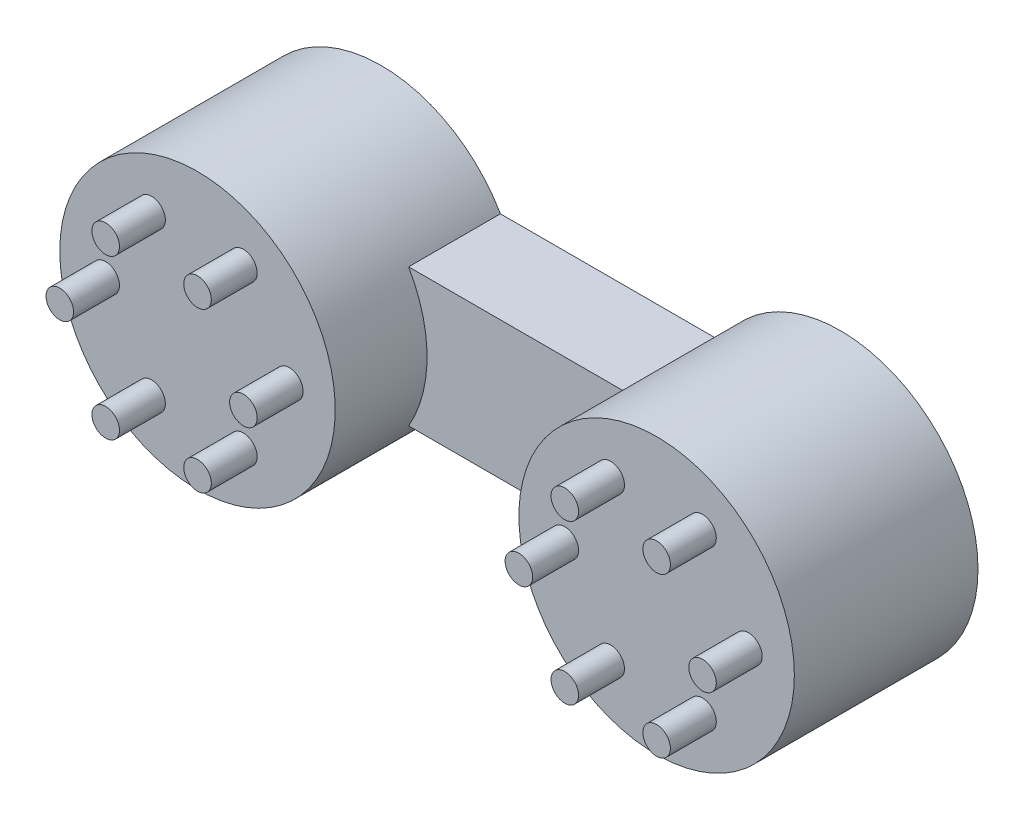
ISO-10303-21;
HEADER;
FILE_DESCRIPTION(('STEP AP214'),'2;1');
FILE_NAME('part.step','',(''),(''),'','','');
FILE_SCHEMA(('AUTOMOTIVE_DESIGN { 1 0 10303 214 1 1 1 1 }'));
ENDSEC;
DATA;
#1=APPLICATION_CONTEXT('core data for automotive mechanical design processes');
#2=APPLICATION_PROTOCOL_DEFINITION('international standard','automotive_design',2000,#1);
#3=PRODUCT_CONTEXT('',#1,'mechanical');
#4=PRODUCT('Part','Part','',(#3));
#5=PRODUCT_RELATED_PRODUCT_CATEGORY('part','',(#4));
#6=PRODUCT_DEFINITION_FORMATION('','',#4);
#7=PRODUCT_DEFINITION_CONTEXT('part definition',#1,'design');
#8=PRODUCT_DEFINITION('design','',#6,#7);
#9=PRODUCT_DEFINITION_SHAPE('','',#8);
#10=(LENGTH_UNIT() NAMED_UNIT(*) SI_UNIT(.MILLI.,.METRE.));
#11=(NAMED_UNIT(*) PLANE_ANGLE_UNIT() SI_UNIT($,.RADIAN.));
#12=(NAMED_UNIT(*) SI_UNIT($,.STERADIAN.) SOLID_ANGLE_UNIT());
#13=UNCERTAINTY_MEASURE_WITH_UNIT(LENGTH_MEASURE(1.E-05),#10,'distance_accuracy_value','');
#14=(GEOMETRIC_REPRESENTATION_CONTEXT(3) GLOBAL_UNCERTAINTY_ASSIGNED_CONTEXT((#13)) GLOBAL_UNIT_ASSIGNED_CONTEXT((#10,
#11,#12)) REPRESENTATION_CONTEXT('',''));
#15=CARTESIAN_POINT('',(0.,0.,0.));
#16=DIRECTION('',(0.,0.,1.));
#17=DIRECTION('',(1.,0.,0.));
#18=AXIS2_PLACEMENT_3D('',#15,#16,#17);
#19=CARTESIAN_POINT('',(-25.,7.5,10.));
#20=DIRECTION('',(0.,-1.,0.));
#21=DIRECTION('',(1.,0.,0.));
#22=AXIS2_PLACEMENT_3D('',#19,#20,#21);
#23=PLANE('',#22);
#24=DIRECTION('',(0.,0.,-1.));
#25=VECTOR('',#24,1.);
#26=CARTESIAN_POINT('',(-12.0096189432334,7.5,20.));
#27=LINE('',#26,#25);
#28=CARTESIAN_POINT('',(-12.0096189432334,7.5,10.));
#29=VERTEX_POINT('',#28);
#30=CARTESIAN_POINT('',(-12.0096189432334,7.5,0.));
#31=VERTEX_POINT('',#30);
#32=EDGE_CURVE('E82',#29,#31,#27,.T.);
#33=ORIENTED_EDGE('',*,*,#32,.F.);
#34=DIRECTION('',(-1.,0.,0.));
#35=VECTOR('',#34,1.);
#36=CARTESIAN_POINT('',(-25.,7.5,10.));
#37=LINE('',#36,#35);
#38=CARTESIAN_POINT('',(12.0096189432334,7.5,10.));
#39=VERTEX_POINT('',#38);
#40=EDGE_CURVE('E100',#39,#29,#37,.T.);
#41=ORIENTED_EDGE('',*,*,#40,.F.);
#42=DIRECTION('',(0.,0.,-1.));
#43=VECTOR('',#42,1.);
#44=CARTESIAN_POINT('',(12.0096189432334,7.5,20.));
#45=LINE('',#44,#43);
#46=CARTESIAN_POINT('',(12.0096189432334,7.5,0.));
#47=VERTEX_POINT('',#46);
#48=EDGE_CURVE('E110',#39,#47,#45,.T.);
#49=ORIENTED_EDGE('',*,*,#48,.T.);
#50=DIRECTION('',(-1.,0.,0.));
#51=VECTOR('',#50,1.);
#52=CARTESIAN_POINT('',(-25.,7.5,0.));
#53=LINE('',#52,#51);
#54=EDGE_CURVE('E101',#47,#31,#53,.T.);
#55=ORIENTED_EDGE('',*,*,#54,.T.);
#56=EDGE_LOOP('',(#33,#41,#49,#55));
#57=FACE_BOUND('',#56,.T.);
#58=ADVANCED_FACE('F40',(#57),#23,.F.);
#59=CARTESIAN_POINT('',(-25.,-7.5,10.));
#60=DIRECTION('',(0.,1.,0.));
#61=DIRECTION('',(-1.,0.,0.));
#62=AXIS2_PLACEMENT_3D('',#59,#60,#61);
#63=PLANE('',#62);
#64=DIRECTION('',(0.,0.,-1.));
#65=VECTOR('',#64,1.);
#66=CARTESIAN_POINT('',(-12.0096189432334,-7.5,20.));
#67=LINE('',#66,#65);
#68=CARTESIAN_POINT('',(-12.0096189432334,-7.5,0.));
#69=VERTEX_POINT('',#68);
#70=CARTESIAN_POINT('',(-12.0096189432334,-7.5,10.));
#71=VERTEX_POINT('',#70);
#72=EDGE_CURVE('E55',#69,#71,#67,.F.);
#73=ORIENTED_EDGE('',*,*,#72,.F.);
#74=DIRECTION('',(1.,0.,0.));
#75=VECTOR('',#74,1.);
#76=CARTESIAN_POINT('',(-25.,-7.5,0.));
#77=LINE('',#76,#75);
#78=CARTESIAN_POINT('',(12.0096189432334,-7.5,0.));
#79=VERTEX_POINT('',#78);
#80=EDGE_CURVE('E93',#69,#79,#77,.T.);
#81=ORIENTED_EDGE('',*,*,#80,.T.);
#82=DIRECTION('',(0.,0.,-1.));
#83=VECTOR('',#82,1.);
#84=CARTESIAN_POINT('',(12.0096189432334,-7.5,20.));
#85=LINE('',#84,#83);
#86=CARTESIAN_POINT('',(12.0096189432334,-7.5,10.));
#87=VERTEX_POINT('',#86);
#88=EDGE_CURVE('E108',#79,#87,#85,.F.);
#89=ORIENTED_EDGE('',*,*,#88,.T.);
#90=DIRECTION('',(1.,0.,0.));
#91=VECTOR('',#90,1.);
#92=CARTESIAN_POINT('',(-25.,-7.5,10.));
#93=LINE('',#92,#91);
#94=EDGE_CURVE('E61',#71,#87,#93,.T.);
#95=ORIENTED_EDGE('',*,*,#94,.F.);
#96=EDGE_LOOP('',(#73,#81,#89,#95));
#97=FACE_BOUND('',#96,.T.);
#98=ADVANCED_FACE('F91',(#97),#63,.F.);
#99=CARTESIAN_POINT('',(25.,0.,20.));
#100=DIRECTION('',(0.,0.,-1.));
#101=DIRECTION('',(-1.,0.,0.));
#102=AXIS2_PLACEMENT_3D('',#99,#100,#101);
#103=CYLINDRICAL_SURFACE('',#102,15.);
#104=CARTESIAN_POINT('',(25.,0.,20.));
#105=DIRECTION('',(0.,0.,1.));
#106=DIRECTION('',(1.,0.,0.));
#107=AXIS2_PLACEMENT_3D('',#104,#105,#106);
#108=CIRCLE('',#107,15.);
#109=CARTESIAN_POINT('',(40.,0.,20.));
#110=VERTEX_POINT('',#109);
#111=EDGE_CURVE('E149',#110,#110,#108,.T.);
#112=ORIENTED_EDGE('',*,*,#111,.F.);
#113=EDGE_LOOP('',(#112));
#114=FACE_BOUND('',#113,.T.);
#115=ORIENTED_EDGE('',*,*,#48,.F.);
#116=CARTESIAN_POINT('',(25.,0.,10.));
#117=DIRECTION('',(0.,0.,1.));
#118=DIRECTION('',(1.,0.,0.));
#119=AXIS2_PLACEMENT_3D('',#116,#117,#118);
#120=CIRCLE('',#119,15.);
#121=EDGE_CURVE('E48',#39,#87,#120,.T.);
#122=ORIENTED_EDGE('',*,*,#121,.T.);
#123=ORIENTED_EDGE('',*,*,#88,.F.);
#124=CARTESIAN_POINT('',(25.,0.,0.));
#125=DIRECTION('',(0.,0.,1.));
#126=DIRECTION('',(1.,0.,0.));
#127=AXIS2_PLACEMENT_3D('',#124,#125,#126);
#128=CIRCLE('',#127,15.);
#129=EDGE_CURVE('E98',#79,#47,#128,.T.);
#130=ORIENTED_EDGE('',*,*,#129,.T.);
#131=EDGE_LOOP('',(#115,#122,#123,#130));
#132=FACE_BOUND('',#131,.T.);
#133=ADVANCED_FACE('F42',(#114,#132),#103,.T.);
#134=CARTESIAN_POINT('',(25.,0.,20.));
#135=DIRECTION('',(0.,0.,1.));
#136=DIRECTION('',(1.,0.,0.));
#137=AXIS2_PLACEMENT_3D('',#134,#135,#136);
#138=PLANE('',#137);
#139=CARTESIAN_POINT('',(30.,8.66025403784439,20.));
#140=DIRECTION('',(0.,0.,1.));
#141=DIRECTION('',(1.,0.,0.));
#142=AXIS2_PLACEMENT_3D('',#139,#140,#141);
#143=CIRCLE('',#142,1.50000000000002);
#144=CARTESIAN_POINT('',(31.5,8.66025403784439,20.));
#145=VERTEX_POINT('',#144);
#146=EDGE_CURVE('E113',#145,#145,#143,.T.);
#147=ORIENTED_EDGE('',*,*,#146,.F.);
#148=EDGE_LOOP('',(#147));
#149=FACE_BOUND('',#148,.T.);
#150=CARTESIAN_POINT('',(20.,8.66025403784439,20.));
#151=DIRECTION('',(0.,0.,1.));
#152=DIRECTION('',(1.,0.,0.));
#153=AXIS2_PLACEMENT_3D('',#150,#151,#152);
#154=CIRCLE('',#153,1.50000000000001);
#155=CARTESIAN_POINT('',(21.5,8.66025403784439,20.));
#156=VERTEX_POINT('',#155);
#157=EDGE_CURVE('E117',#156,#156,#154,.T.);
#158=ORIENTED_EDGE('',*,*,#157,.F.);
#159=EDGE_LOOP('',(#158));
#160=FACE_BOUND('',#159,.T.);
#161=CARTESIAN_POINT('',(15.,0.,20.));
#162=DIRECTION('',(0.,0.,1.));
#163=DIRECTION('',(1.,0.,0.));
#164=AXIS2_PLACEMENT_3D('',#161,#162,#163);
#165=CIRCLE('',#164,1.5);
#166=CARTESIAN_POINT('',(16.5,0.,20.));
#167=VERTEX_POINT('',#166);
#168=EDGE_CURVE('E123',#167,#167,#165,.T.);
#169=ORIENTED_EDGE('',*,*,#168,.F.);
#170=EDGE_LOOP('',(#169));
#171=FACE_BOUND('',#170,.T.);
#172=CARTESIAN_POINT('',(20.,-8.66025403784439,20.));
#173=DIRECTION('',(0.,0.,1.));
#174=DIRECTION('',(1.,0.,0.));
#175=AXIS2_PLACEMENT_3D('',#172,#173,#174);
#176=CIRCLE('',#175,1.5);
#177=CARTESIAN_POINT('',(21.5,-8.66025403784439,20.));
#178=VERTEX_POINT('',#177);
#179=EDGE_CURVE('E129',#178,#178,#176,.T.);
#180=ORIENTED_EDGE('',*,*,#179,.F.);
#181=EDGE_LOOP('',(#180));
#182=FACE_BOUND('',#181,.T.);
#183=CARTESIAN_POINT('',(30.,-8.66025403784439,20.));
#184=DIRECTION('',(0.,0.,1.));
#185=DIRECTION('',(1.,0.,0.));
#186=AXIS2_PLACEMENT_3D('',#183,#184,#185);
#187=CIRCLE('',#186,1.50000000000001);
#188=CARTESIAN_POINT('',(31.5,-8.66025403784439,20.));
#189=VERTEX_POINT('',#188);
#190=EDGE_CURVE('E135',#189,#189,#187,.T.);
#191=ORIENTED_EDGE('',*,*,#190,.F.);
#192=EDGE_LOOP('',(#191));
#193=FACE_BOUND('',#192,.T.);
#194=CARTESIAN_POINT('',(35.,0.,20.));
#195=DIRECTION('',(0.,0.,1.));
#196=DIRECTION('',(1.,0.,0.));
#197=AXIS2_PLACEMENT_3D('',#194,#195,#196);
#198=CIRCLE('',#197,1.5);
#199=CARTESIAN_POINT('',(36.5,0.,20.));
#200=VERTEX_POINT('',#199);
#201=EDGE_CURVE('E141',#200,#200,#198,.T.);
#202=ORIENTED_EDGE('',*,*,#201,.F.);
#203=EDGE_LOOP('',(#202));
#204=FACE_BOUND('',#203,.T.);
#205=ORIENTED_EDGE('',*,*,#111,.T.);
#206=EDGE_LOOP('',(#205));
#207=FACE_BOUND('',#206,.T.);
#208=ADVANCED_FACE('F282',(#149,#160,#171,#182,#193,#204,#207),#138,.T.);
#209=CARTESIAN_POINT('',(25.,0.,0.));
#210=DIRECTION('',(0.,0.,1.));
#211=DIRECTION('',(1.,0.,0.));
#212=AXIS2_PLACEMENT_3D('',#209,#210,#211);
#213=PLANE('',#212);
#214=ORIENTED_EDGE('',*,*,#80,.F.);
#215=CARTESIAN_POINT('',(-25.,0.,0.));
#216=DIRECTION('',(0.,0.,1.));
#217=DIRECTION('',(-1.,0.,0.));
#218=AXIS2_PLACEMENT_3D('',#215,#216,#217);
#219=CIRCLE('',#218,15.);
#220=EDGE_CURVE('E79',#31,#69,#219,.T.);
#221=ORIENTED_EDGE('',*,*,#220,.F.);
#222=ORIENTED_EDGE('',*,*,#54,.F.);
#223=ORIENTED_EDGE('',*,*,#129,.F.);
#224=EDGE_LOOP('',(#214,#221,#222,#223));
#225=FACE_BOUND('',#224,.T.);
#226=ADVANCED_FACE('F97',(#225),#213,.F.);
#227=CARTESIAN_POINT('',(35.,0.,25.));
#228=DIRECTION('',(0.,0.,-1.));
#229=DIRECTION('',(-1.,0.,0.));
#230=AXIS2_PLACEMENT_3D('',#227,#228,#229);
#231=CYLINDRICAL_SURFACE('',#230,1.5);
#232=CARTESIAN_POINT('',(35.,0.,25.));
#233=DIRECTION('',(0.,0.,1.));
#234=DIRECTION('',(1.,0.,0.));
#235=AXIS2_PLACEMENT_3D('',#232,#233,#234);
#236=CIRCLE('',#235,1.5);
#237=CARTESIAN_POINT('',(36.5,0.,25.));
#238=VERTEX_POINT('',#237);
#239=EDGE_CURVE('E144',#238,#238,#236,.T.);
#240=ORIENTED_EDGE('',*,*,#239,.F.);
#241=EDGE_LOOP('',(#240));
#242=FACE_BOUND('',#241,.T.);
#243=ORIENTED_EDGE('',*,*,#201,.T.);
#244=EDGE_LOOP('',(#243));
#245=FACE_BOUND('',#244,.T.);
#246=ADVANCED_FACE('F277',(#242,#245),#231,.T.);
#247=CARTESIAN_POINT('',(35.,0.,25.));
#248=DIRECTION('',(0.,0.,1.));
#249=DIRECTION('',(1.,0.,0.));
#250=AXIS2_PLACEMENT_3D('',#247,#248,#249);
#251=PLANE('',#250);
#252=ORIENTED_EDGE('',*,*,#239,.T.);
#253=EDGE_LOOP('',(#252));
#254=FACE_BOUND('',#253,.T.);
#255=ADVANCED_FACE('F273',(#254),#251,.T.);
#256=CARTESIAN_POINT('',(30.,-8.66025403784439,25.));
#257=DIRECTION('',(0.,0.,-1.));
#258=DIRECTION('',(-1.,0.,0.));
#259=AXIS2_PLACEMENT_3D('',#256,#257,#258);
#260=CYLINDRICAL_SURFACE('',#259,1.50000000000001);
#261=CARTESIAN_POINT('',(30.,-8.66025403784439,25.));
#262=DIRECTION('',(0.,0.,1.));
#263=DIRECTION('',(1.,0.,0.));
#264=AXIS2_PLACEMENT_3D('',#261,#262,#263);
#265=CIRCLE('',#264,1.50000000000001);
#266=CARTESIAN_POINT('',(31.5,-8.66025403784439,25.));
#267=VERTEX_POINT('',#266);
#268=EDGE_CURVE('E138',#267,#267,#265,.T.);
#269=ORIENTED_EDGE('',*,*,#268,.F.);
#270=EDGE_LOOP('',(#269));
#271=FACE_BOUND('',#270,.T.);
#272=ORIENTED_EDGE('',*,*,#190,.T.);
#273=EDGE_LOOP('',(#272));
#274=FACE_BOUND('',#273,.T.);
#275=ADVANCED_FACE('F269',(#271,#274),#260,.T.);
#276=CARTESIAN_POINT('',(30.,-8.66025403784439,25.));
#277=DIRECTION('',(0.,0.,1.));
#278=DIRECTION('',(1.,0.,0.));
#279=AXIS2_PLACEMENT_3D('',#276,#277,#278);
#280=PLANE('',#279);
#281=ORIENTED_EDGE('',*,*,#268,.T.);
#282=EDGE_LOOP('',(#281));
#283=FACE_BOUND('',#282,.T.);
#284=ADVANCED_FACE('F265',(#283),#280,.T.);
#285=CARTESIAN_POINT('',(20.,-8.66025403784439,25.));
#286=DIRECTION('',(0.,0.,-1.));
#287=DIRECTION('',(-1.,0.,0.));
#288=AXIS2_PLACEMENT_3D('',#285,#286,#287);
#289=CYLINDRICAL_SURFACE('',#288,1.5);
#290=CARTESIAN_POINT('',(20.,-8.66025403784439,25.));
#291=DIRECTION('',(0.,0.,1.));
#292=DIRECTION('',(1.,0.,0.));
#293=AXIS2_PLACEMENT_3D('',#290,#291,#292);
#294=CIRCLE('',#293,1.5);
#295=CARTESIAN_POINT('',(21.5,-8.66025403784439,25.));
#296=VERTEX_POINT('',#295);
#297=EDGE_CURVE('E132',#296,#296,#294,.T.);
#298=ORIENTED_EDGE('',*,*,#297,.F.);
#299=EDGE_LOOP('',(#298));
#300=FACE_BOUND('',#299,.T.);
#301=ORIENTED_EDGE('',*,*,#179,.T.);
#302=EDGE_LOOP('',(#301));
#303=FACE_BOUND('',#302,.T.);
#304=ADVANCED_FACE('F261',(#300,#303),#289,.T.);
#305=CARTESIAN_POINT('',(20.,-8.66025403784439,25.));
#306=DIRECTION('',(0.,0.,1.));
#307=DIRECTION('',(1.,0.,0.));
#308=AXIS2_PLACEMENT_3D('',#305,#306,#307);
#309=PLANE('',#308);
#310=ORIENTED_EDGE('',*,*,#297,.T.);
#311=EDGE_LOOP('',(#310));
#312=FACE_BOUND('',#311,.T.);
#313=ADVANCED_FACE('F257',(#312),#309,.T.);
#314=CARTESIAN_POINT('',(15.,0.,25.));
#315=DIRECTION('',(0.,0.,-1.));
#316=DIRECTION('',(-1.,0.,0.));
#317=AXIS2_PLACEMENT_3D('',#314,#315,#316);
#318=CYLINDRICAL_SURFACE('',#317,1.5);
#319=CARTESIAN_POINT('',(15.,0.,25.));
#320=DIRECTION('',(0.,0.,1.));
#321=DIRECTION('',(1.,0.,0.));
#322=AXIS2_PLACEMENT_3D('',#319,#320,#321);
#323=CIRCLE('',#322,1.5);
#324=CARTESIAN_POINT('',(16.5,0.,25.));
#325=VERTEX_POINT('',#324);
#326=EDGE_CURVE('E126',#325,#325,#323,.T.);
#327=ORIENTED_EDGE('',*,*,#326,.F.);
#328=EDGE_LOOP('',(#327));
#329=FACE_BOUND('',#328,.T.);
#330=ORIENTED_EDGE('',*,*,#168,.T.);
#331=EDGE_LOOP('',(#330));
#332=FACE_BOUND('',#331,.T.);
#333=ADVANCED_FACE('F253',(#329,#332),#318,.T.);
#334=CARTESIAN_POINT('',(15.,0.,25.));
#335=DIRECTION('',(0.,0.,1.));
#336=DIRECTION('',(1.,0.,0.));
#337=AXIS2_PLACEMENT_3D('',#334,#335,#336);
#338=PLANE('',#337);
#339=ORIENTED_EDGE('',*,*,#326,.T.);
#340=EDGE_LOOP('',(#339));
#341=FACE_BOUND('',#340,.T.);
#342=ADVANCED_FACE('F249',(#341),#338,.T.);
#343=CARTESIAN_POINT('',(20.,8.66025403784439,25.));
#344=DIRECTION('',(0.,0.,-1.));
#345=DIRECTION('',(-1.,0.,0.));
#346=AXIS2_PLACEMENT_3D('',#343,#344,#345);
#347=CYLINDRICAL_SURFACE('',#346,1.50000000000001);
#348=CARTESIAN_POINT('',(20.,8.66025403784439,25.));
#349=DIRECTION('',(0.,0.,1.));
#350=DIRECTION('',(1.,0.,0.));
#351=AXIS2_PLACEMENT_3D('',#348,#349,#350);
#352=CIRCLE('',#351,1.50000000000001);
#353=CARTESIAN_POINT('',(21.5,8.66025403784439,25.));
#354=VERTEX_POINT('',#353);
#355=EDGE_CURVE('E120',#354,#354,#352,.T.);
#356=ORIENTED_EDGE('',*,*,#355,.F.);
#357=EDGE_LOOP('',(#356));
#358=FACE_BOUND('',#357,.T.);
#359=ORIENTED_EDGE('',*,*,#157,.T.);
#360=EDGE_LOOP('',(#359));
#361=FACE_BOUND('',#360,.T.);
#362=ADVANCED_FACE('F245',(#358,#361),#347,.T.);
#363=CARTESIAN_POINT('',(20.,8.66025403784439,25.));
#364=DIRECTION('',(0.,0.,1.));
#365=DIRECTION('',(1.,0.,0.));
#366=AXIS2_PLACEMENT_3D('',#363,#364,#365);
#367=PLANE('',#366);
#368=ORIENTED_EDGE('',*,*,#355,.T.);
#369=EDGE_LOOP('',(#368));
#370=FACE_BOUND('',#369,.T.);
#371=ADVANCED_FACE('F241',(#370),#367,.T.);
#372=CARTESIAN_POINT('',(30.,8.66025403784439,25.));
#373=DIRECTION('',(0.,0.,-1.));
#374=DIRECTION('',(-1.,0.,0.));
#375=AXIS2_PLACEMENT_3D('',#372,#373,#374);
#376=CYLINDRICAL_SURFACE('',#375,1.50000000000002);
#377=CARTESIAN_POINT('',(30.,8.66025403784439,25.));
#378=DIRECTION('',(0.,0.,1.));
#379=DIRECTION('',(1.,0.,0.));
#380=AXIS2_PLACEMENT_3D('',#377,#378,#379);
#381=CIRCLE('',#380,1.50000000000002);
#382=CARTESIAN_POINT('',(31.5,8.66025403784439,25.));
#383=VERTEX_POINT('',#382);
#384=EDGE_CURVE('E114',#383,#383,#381,.T.);
#385=ORIENTED_EDGE('',*,*,#384,.F.);
#386=EDGE_LOOP('',(#385));
#387=FACE_BOUND('',#386,.T.);
#388=ORIENTED_EDGE('',*,*,#146,.T.);
#389=EDGE_LOOP('',(#388));
#390=FACE_BOUND('',#389,.T.);
#391=ADVANCED_FACE('F237',(#387,#390),#376,.T.);
#392=CARTESIAN_POINT('',(30.,8.66025403784439,25.));
#393=DIRECTION('',(0.,0.,1.));
#394=DIRECTION('',(1.,0.,0.));
#395=AXIS2_PLACEMENT_3D('',#392,#393,#394);
#396=PLANE('',#395);
#397=ORIENTED_EDGE('',*,*,#384,.T.);
#398=EDGE_LOOP('',(#397));
#399=FACE_BOUND('',#398,.T.);
#400=ADVANCED_FACE('F226',(#399),#396,.T.);
#401=CARTESIAN_POINT('',(0.,0.,10.));
#402=DIRECTION('',(0.,0.,1.));
#403=DIRECTION('',(1.,0.,0.));
#404=AXIS2_PLACEMENT_3D('',#401,#402,#403);
#405=PLANE('',#404);
#406=ORIENTED_EDGE('',*,*,#40,.T.);
#407=CARTESIAN_POINT('',(-25.,0.,10.));
#408=DIRECTION('',(0.,0.,1.));
#409=DIRECTION('',(1.,0.,0.));
#410=AXIS2_PLACEMENT_3D('',#407,#408,#409);
#411=CIRCLE('',#410,15.);
#412=EDGE_CURVE('E11',#29,#71,#411,.F.);
#413=ORIENTED_EDGE('',*,*,#412,.T.);
#414=ORIENTED_EDGE('',*,*,#94,.T.);
#415=ORIENTED_EDGE('',*,*,#121,.F.);
#416=EDGE_LOOP('',(#406,#413,#414,#415));
#417=FACE_BOUND('',#416,.T.);
#418=ADVANCED_FACE('F154',(#417),#405,.T.);
#419=CARTESIAN_POINT('',(-25.,0.,20.));
#420=DIRECTION('',(0.,0.,-1.));
#421=DIRECTION('',(-1.,0.,0.));
#422=AXIS2_PLACEMENT_3D('',#419,#420,#421);
#423=CYLINDRICAL_SURFACE('',#422,15.);
#424=CARTESIAN_POINT('',(-25.,0.,20.));
#425=DIRECTION('',(0.,0.,1.));
#426=DIRECTION('',(-1.,0.,0.));
#427=AXIS2_PLACEMENT_3D('',#424,#425,#426);
#428=CIRCLE('',#427,15.);
#429=CARTESIAN_POINT('',(-40.,0.,20.));
#430=VERTEX_POINT('',#429);
#431=EDGE_CURVE('E87',#430,#430,#428,.T.);
#432=ORIENTED_EDGE('',*,*,#431,.F.);
#433=EDGE_LOOP('',(#432));
#434=FACE_BOUND('',#433,.T.);
#435=ORIENTED_EDGE('',*,*,#412,.F.);
#436=ORIENTED_EDGE('',*,*,#32,.T.);
#437=ORIENTED_EDGE('',*,*,#220,.T.);
#438=ORIENTED_EDGE('',*,*,#72,.T.);
#439=EDGE_LOOP('',(#435,#436,#437,#438));
#440=FACE_BOUND('',#439,.T.);
#441=ADVANCED_FACE('F80',(#434,#440),#423,.T.);
#442=CARTESIAN_POINT('',(-25.,0.,20.));
#443=DIRECTION('',(0.,0.,-1.));
#444=DIRECTION('',(-1.,0.,0.));
#445=AXIS2_PLACEMENT_3D('',#442,#443,#444);
#446=PLANE('',#445);
#447=CARTESIAN_POINT('',(-20.,8.66025403784439,20.));
#448=DIRECTION('',(0.,0.,-1.));
#449=DIRECTION('',(-1.,0.,0.));
#450=AXIS2_PLACEMENT_3D('',#447,#448,#449);
#451=CIRCLE('',#450,1.50000000000001);
#452=CARTESIAN_POINT('',(-21.5,8.66025403784439,20.));
#453=VERTEX_POINT('',#452);
#454=EDGE_CURVE('E95',#453,#453,#451,.F.);
#455=ORIENTED_EDGE('',*,*,#454,.F.);
#456=EDGE_LOOP('',(#455));
#457=FACE_BOUND('',#456,.T.);
#458=CARTESIAN_POINT('',(-30.,8.66025403784439,20.));
#459=DIRECTION('',(0.,0.,-1.));
#460=DIRECTION('',(-1.,0.,0.));
#461=AXIS2_PLACEMENT_3D('',#458,#459,#460);
#462=CIRCLE('',#461,1.50000000000002);
#463=CARTESIAN_POINT('',(-31.5,8.66025403784439,20.));
#464=VERTEX_POINT('',#463);
#465=EDGE_CURVE('E160',#464,#464,#462,.F.);
#466=ORIENTED_EDGE('',*,*,#465,.F.);
#467=EDGE_LOOP('',(#466));
#468=FACE_BOUND('',#467,.T.);
#469=CARTESIAN_POINT('',(-35.,0.,20.));
#470=DIRECTION('',(0.,0.,-1.));
#471=DIRECTION('',(-1.,0.,0.));
#472=AXIS2_PLACEMENT_3D('',#469,#470,#471);
#473=CIRCLE('',#472,1.5);
#474=CARTESIAN_POINT('',(-36.5,0.,20.));
#475=VERTEX_POINT('',#474);
#476=EDGE_CURVE('E163',#475,#475,#473,.F.);
#477=ORIENTED_EDGE('',*,*,#476,.F.);
#478=EDGE_LOOP('',(#477));
#479=FACE_BOUND('',#478,.T.);
#480=CARTESIAN_POINT('',(-30.,-8.66025403784439,20.));
#481=DIRECTION('',(0.,0.,-1.));
#482=DIRECTION('',(-1.,0.,0.));
#483=AXIS2_PLACEMENT_3D('',#480,#481,#482);
#484=CIRCLE('',#483,1.50000000000001);
#485=CARTESIAN_POINT('',(-31.5,-8.66025403784439,20.));
#486=VERTEX_POINT('',#485);
#487=EDGE_CURVE('E166',#486,#486,#484,.F.);
#488=ORIENTED_EDGE('',*,*,#487,.F.);
#489=EDGE_LOOP('',(#488));
#490=FACE_BOUND('',#489,.T.);
#491=CARTESIAN_POINT('',(-20.,-8.66025403784439,20.));
#492=DIRECTION('',(0.,0.,-1.));
#493=DIRECTION('',(-1.,0.,0.));
#494=AXIS2_PLACEMENT_3D('',#491,#492,#493);
#495=CIRCLE('',#494,1.5);
#496=CARTESIAN_POINT('',(-21.5,-8.66025403784439,20.));
#497=VERTEX_POINT('',#496);
#498=EDGE_CURVE('E169',#497,#497,#495,.F.);
#499=ORIENTED_EDGE('',*,*,#498,.F.);
#500=EDGE_LOOP('',(#499));
#501=FACE_BOUND('',#500,.T.);
#502=CARTESIAN_POINT('',(-15.,0.,20.));
#503=DIRECTION('',(0.,0.,-1.));
#504=DIRECTION('',(-1.,0.,0.));
#505=AXIS2_PLACEMENT_3D('',#502,#503,#504);
#506=CIRCLE('',#505,1.5);
#507=CARTESIAN_POINT('',(-16.5,0.,20.));
#508=VERTEX_POINT('',#507);
#509=EDGE_CURVE('E172',#508,#508,#506,.F.);
#510=ORIENTED_EDGE('',*,*,#509,.F.);
#511=EDGE_LOOP('',(#510));
#512=FACE_BOUND('',#511,.T.);
#513=ORIENTED_EDGE('',*,*,#431,.T.);
#514=EDGE_LOOP('',(#513));
#515=FACE_BOUND('',#514,.T.);
#516=ADVANCED_FACE('F204',(#457,#468,#479,#490,#501,#512,#515),#446,.F.);
#517=CARTESIAN_POINT('',(-15.,0.,25.));
#518=DIRECTION('',(0.,0.,-1.));
#519=DIRECTION('',(-1.,0.,0.));
#520=AXIS2_PLACEMENT_3D('',#517,#518,#519);
#521=CYLINDRICAL_SURFACE('',#520,1.5);
#522=CARTESIAN_POINT('',(-15.,0.,25.));
#523=DIRECTION('',(0.,0.,1.));
#524=DIRECTION('',(-1.,0.,0.));
#525=AXIS2_PLACEMENT_3D('',#522,#523,#524);
#526=CIRCLE('',#525,1.5);
#527=CARTESIAN_POINT('',(-16.5,0.,25.));
#528=VERTEX_POINT('',#527);
#529=EDGE_CURVE('E88',#528,#528,#526,.T.);
#530=ORIENTED_EDGE('',*,*,#529,.F.);
#531=EDGE_LOOP('',(#530));
#532=FACE_BOUND('',#531,.T.);
#533=ORIENTED_EDGE('',*,*,#509,.T.);
#534=EDGE_LOOP('',(#533));
#535=FACE_BOUND('',#534,.T.);
#536=ADVANCED_FACE('F207',(#532,#535),#521,.T.);
#537=CARTESIAN_POINT('',(-15.,0.,25.));
#538=DIRECTION('',(0.,0.,-1.));
#539=DIRECTION('',(-1.,0.,0.));
#540=AXIS2_PLACEMENT_3D('',#537,#538,#539);
#541=PLANE('',#540);
#542=ORIENTED_EDGE('',*,*,#529,.T.);
#543=EDGE_LOOP('',(#542));
#544=FACE_BOUND('',#543,.T.);
#545=ADVANCED_FACE('F362',(#544),#541,.F.);
#546=CARTESIAN_POINT('',(-20.,-8.66025403784439,25.));
#547=DIRECTION('',(0.,0.,-1.));
#548=DIRECTION('',(-1.,0.,0.));
#549=AXIS2_PLACEMENT_3D('',#546,#547,#548);
#550=CYLINDRICAL_SURFACE('',#549,1.5);
#551=CARTESIAN_POINT('',(-20.,-8.66025403784439,25.));
#552=DIRECTION('',(0.,0.,1.));
#553=DIRECTION('',(-1.,0.,0.));
#554=AXIS2_PLACEMENT_3D('',#551,#552,#553);
#555=CIRCLE('',#554,1.5);
#556=CARTESIAN_POINT('',(-21.5,-8.66025403784439,25.));
#557=VERTEX_POINT('',#556);
#558=EDGE_CURVE('E179',#557,#557,#555,.T.);
#559=ORIENTED_EDGE('',*,*,#558,.F.);
#560=EDGE_LOOP('',(#559));
#561=FACE_BOUND('',#560,.T.);
#562=ORIENTED_EDGE('',*,*,#498,.T.);
#563=EDGE_LOOP('',(#562));
#564=FACE_BOUND('',#563,.T.);
#565=ADVANCED_FACE('F372',(#561,#564),#550,.T.);
#566=CARTESIAN_POINT('',(-20.,-8.66025403784439,25.));
#567=DIRECTION('',(0.,0.,-1.));
#568=DIRECTION('',(-1.,0.,0.));
#569=AXIS2_PLACEMENT_3D('',#566,#567,#568);
#570=PLANE('',#569);
#571=ORIENTED_EDGE('',*,*,#558,.T.);
#572=EDGE_LOOP('',(#571));
#573=FACE_BOUND('',#572,.T.);
#574=ADVANCED_FACE('F382',(#573),#570,.F.);
#575=CARTESIAN_POINT('',(-30.,-8.66025403784439,25.));
#576=DIRECTION('',(0.,0.,-1.));
#577=DIRECTION('',(-1.,0.,0.));
#578=AXIS2_PLACEMENT_3D('',#575,#576,#577);
#579=CYLINDRICAL_SURFACE('',#578,1.50000000000001);
#580=CARTESIAN_POINT('',(-30.,-8.66025403784439,25.));
#581=DIRECTION('',(0.,0.,1.));
#582=DIRECTION('',(-1.,0.,0.));
#583=AXIS2_PLACEMENT_3D('',#580,#581,#582);
#584=CIRCLE('',#583,1.50000000000001);
#585=CARTESIAN_POINT('',(-31.5,-8.66025403784439,25.));
#586=VERTEX_POINT('',#585);
#587=EDGE_CURVE('E182',#586,#586,#584,.T.);
#588=ORIENTED_EDGE('',*,*,#587,.F.);
#589=EDGE_LOOP('',(#588));
#590=FACE_BOUND('',#589,.T.);
#591=ORIENTED_EDGE('',*,*,#487,.T.);
#592=EDGE_LOOP('',(#591));
#593=FACE_BOUND('',#592,.T.);
#594=ADVANCED_FACE('F392',(#590,#593),#579,.T.);
#595=CARTESIAN_POINT('',(-30.,-8.66025403784439,25.));
#596=DIRECTION('',(0.,0.,-1.));
#597=DIRECTION('',(-1.,0.,0.));
#598=AXIS2_PLACEMENT_3D('',#595,#596,#597);
#599=PLANE('',#598);
#600=ORIENTED_EDGE('',*,*,#587,.T.);
#601=EDGE_LOOP('',(#600));
#602=FACE_BOUND('',#601,.T.);
#603=ADVANCED_FACE('F402',(#602),#599,.F.);
#604=CARTESIAN_POINT('',(-35.,0.,25.));
#605=DIRECTION('',(0.,0.,-1.));
#606=DIRECTION('',(-1.,0.,0.));
#607=AXIS2_PLACEMENT_3D('',#604,#605,#606);
#608=CYLINDRICAL_SURFACE('',#607,1.5);
#609=CARTESIAN_POINT('',(-35.,0.,25.));
#610=DIRECTION('',(0.,0.,1.));
#611=DIRECTION('',(-1.,0.,0.));
#612=AXIS2_PLACEMENT_3D('',#609,#610,#611);
#613=CIRCLE('',#612,1.5);
#614=CARTESIAN_POINT('',(-36.5,0.,25.));
#615=VERTEX_POINT('',#614);
#616=EDGE_CURVE('E185',#615,#615,#613,.T.);
#617=ORIENTED_EDGE('',*,*,#616,.F.);
#618=EDGE_LOOP('',(#617));
#619=FACE_BOUND('',#618,.T.);
#620=ORIENTED_EDGE('',*,*,#476,.T.);
#621=EDGE_LOOP('',(#620));
#622=FACE_BOUND('',#621,.T.);
#623=ADVANCED_FACE('F412',(#619,#622),#608,.T.);
#624=CARTESIAN_POINT('',(-35.,0.,25.));
#625=DIRECTION('',(0.,0.,-1.));
#626=DIRECTION('',(-1.,0.,0.));
#627=AXIS2_PLACEMENT_3D('',#624,#625,#626);
#628=PLANE('',#627);
#629=ORIENTED_EDGE('',*,*,#616,.T.);
#630=EDGE_LOOP('',(#629));
#631=FACE_BOUND('',#630,.T.);
#632=ADVANCED_FACE('F422',(#631),#628,.F.);
#633=CARTESIAN_POINT('',(-30.,8.66025403784439,25.));
#634=DIRECTION('',(0.,0.,-1.));
#635=DIRECTION('',(-1.,0.,0.));
#636=AXIS2_PLACEMENT_3D('',#633,#634,#635);
#637=CYLINDRICAL_SURFACE('',#636,1.50000000000002);
#638=CARTESIAN_POINT('',(-30.,8.66025403784439,25.));
#639=DIRECTION('',(0.,0.,1.));
#640=DIRECTION('',(-1.,0.,0.));
#641=AXIS2_PLACEMENT_3D('',#638,#639,#640);
#642=CIRCLE('',#641,1.50000000000002);
#643=CARTESIAN_POINT('',(-31.5,8.66025403784439,25.));
#644=VERTEX_POINT('',#643);
#645=EDGE_CURVE('E188',#644,#644,#642,.T.);
#646=ORIENTED_EDGE('',*,*,#645,.F.);
#647=EDGE_LOOP('',(#646));
#648=FACE_BOUND('',#647,.T.);
#649=ORIENTED_EDGE('',*,*,#465,.T.);
#650=EDGE_LOOP('',(#649));
#651=FACE_BOUND('',#650,.T.);
#652=ADVANCED_FACE('F432',(#648,#651),#637,.T.);
#653=CARTESIAN_POINT('',(-30.,8.66025403784439,25.));
#654=DIRECTION('',(0.,0.,-1.));
#655=DIRECTION('',(-1.,0.,0.));
#656=AXIS2_PLACEMENT_3D('',#653,#654,#655);
#657=PLANE('',#656);
#658=ORIENTED_EDGE('',*,*,#645,.T.);
#659=EDGE_LOOP('',(#658));
#660=FACE_BOUND('',#659,.T.);
#661=ADVANCED_FACE('F200',(#660),#657,.F.);
#662=CARTESIAN_POINT('',(-20.,8.66025403784439,25.));
#663=DIRECTION('',(0.,0.,-1.));
#664=DIRECTION('',(-1.,0.,0.));
#665=AXIS2_PLACEMENT_3D('',#662,#663,#664);
#666=CYLINDRICAL_SURFACE('',#665,1.50000000000001);
#667=CARTESIAN_POINT('',(-20.,8.66025403784439,25.));
#668=DIRECTION('',(0.,0.,1.));
#669=DIRECTION('',(-1.,0.,0.));
#670=AXIS2_PLACEMENT_3D('',#667,#668,#669);
#671=CIRCLE('',#670,1.50000000000001);
#672=CARTESIAN_POINT('',(-21.5,8.66025403784439,25.));
#673=VERTEX_POINT('',#672);
#674=EDGE_CURVE('E191',#673,#673,#671,.T.);
#675=ORIENTED_EDGE('',*,*,#674,.F.);
#676=EDGE_LOOP('',(#675));
#677=FACE_BOUND('',#676,.T.);
#678=ORIENTED_EDGE('',*,*,#454,.T.);
#679=EDGE_LOOP('',(#678));
#680=FACE_BOUND('',#679,.T.);
#681=ADVANCED_FACE('F197',(#677,#680),#666,.T.);
#682=CARTESIAN_POINT('',(-20.,8.66025403784439,25.));
#683=DIRECTION('',(0.,0.,-1.));
#684=DIRECTION('',(-1.,0.,0.));
#685=AXIS2_PLACEMENT_3D('',#682,#683,#684);
#686=PLANE('',#685);
#687=ORIENTED_EDGE('',*,*,#674,.T.);
#688=EDGE_LOOP('',(#687));
#689=FACE_BOUND('',#688,.T.);
#690=ADVANCED_FACE('F195',(#689),#686,.F.);
#691=CLOSED_SHELL('',(#58,#98,#133,#208,#226,#246,#255,#275,#284,#304,#313,#333,#342,#362,#371,
#391,#400,#418,#441,#516,#536,#545,#565,#574,#594,#603,#623,#632,#652,#661,#681,#690));
#692=MANIFOLD_SOLID_BREP('B2',#691);
#693=ADVANCED_BREP_SHAPE_REPRESENTATION('',(#18,#692),#14);
#694=SHAPE_DEFINITION_REPRESENTATION(#9,#693);
ENDSEC;
END-ISO-10303-21;
